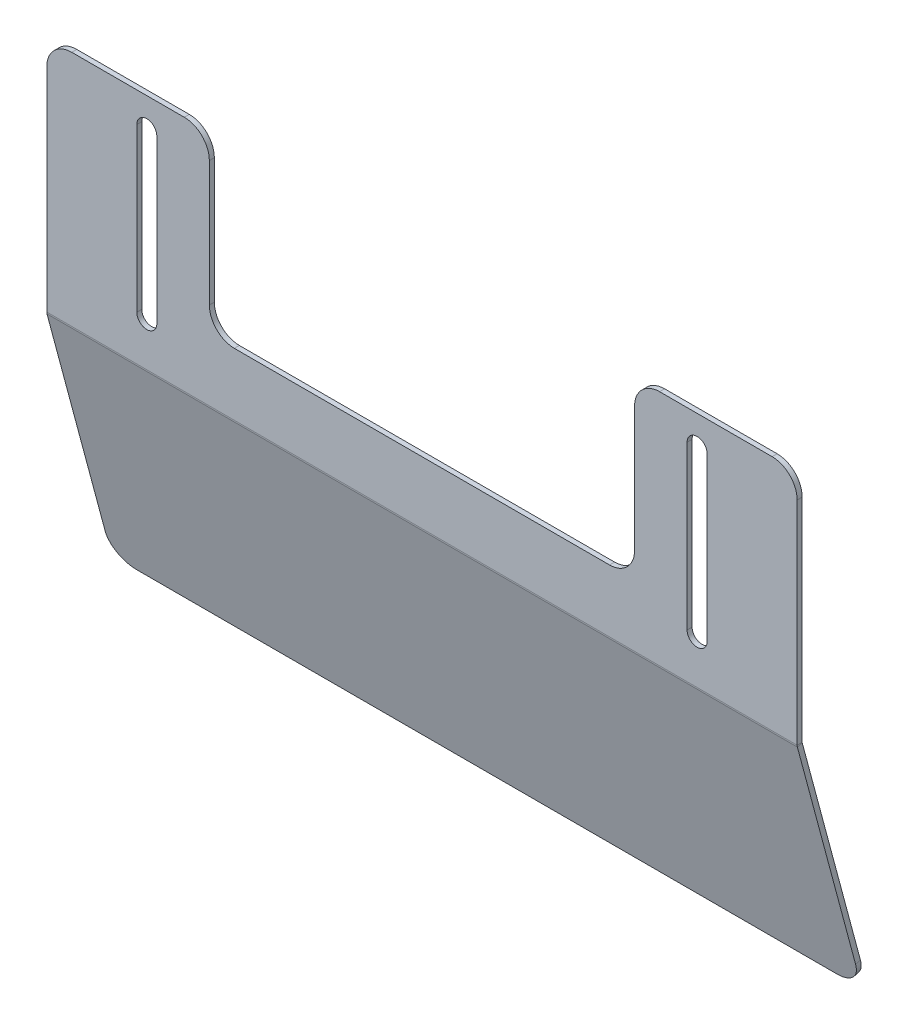
ISO-10303-21;
HEADER;
FILE_DESCRIPTION(('STEP AP214'),'2;1');
FILE_NAME('part.step','',(''),(''),'','','');
FILE_SCHEMA(('AUTOMOTIVE_DESIGN { 1 0 10303 214 1 1 1 1 }'));
ENDSEC;
DATA;
#1=APPLICATION_CONTEXT('core data for automotive mechanical design processes');
#2=APPLICATION_PROTOCOL_DEFINITION('international standard','automotive_design',2000,#1);
#3=PRODUCT_CONTEXT('',#1,'mechanical');
#4=PRODUCT('Part','Part','',(#3));
#5=PRODUCT_RELATED_PRODUCT_CATEGORY('part','',(#4));
#6=PRODUCT_DEFINITION_FORMATION('','',#4);
#7=PRODUCT_DEFINITION_CONTEXT('part definition',#1,'design');
#8=PRODUCT_DEFINITION('design','',#6,#7);
#9=PRODUCT_DEFINITION_SHAPE('','',#8);
#10=(LENGTH_UNIT() NAMED_UNIT(*) SI_UNIT(.MILLI.,.METRE.));
#11=(NAMED_UNIT(*) PLANE_ANGLE_UNIT() SI_UNIT($,.RADIAN.));
#12=(NAMED_UNIT(*) SI_UNIT($,.STERADIAN.) SOLID_ANGLE_UNIT());
#13=UNCERTAINTY_MEASURE_WITH_UNIT(LENGTH_MEASURE(1.E-05),#10,'distance_accuracy_value','');
#14=(GEOMETRIC_REPRESENTATION_CONTEXT(3) GLOBAL_UNCERTAINTY_ASSIGNED_CONTEXT((#13)) GLOBAL_UNIT_ASSIGNED_CONTEXT((#10,
#11,#12)) REPRESENTATION_CONTEXT('',''));
#15=CARTESIAN_POINT('',(0.,0.,0.));
#16=DIRECTION('',(0.,0.,1.));
#17=DIRECTION('',(1.,0.,0.));
#18=AXIS2_PLACEMENT_3D('',#15,#16,#17);
#19=CARTESIAN_POINT('',(-106.,35.5,0.));
#20=DIRECTION('',(-1.,0.,0.));
#21=DIRECTION('',(0.,1.,0.));
#22=AXIS2_PLACEMENT_3D('',#19,#20,#21);
#23=PLANE('',#22);
#24=DIRECTION('',(0.,0.,1.));
#25=VECTOR('',#24,1.);
#26=CARTESIAN_POINT('',(-106.,35.5,0.));
#27=LINE('',#26,#25);
#28=CARTESIAN_POINT('',(-106.,35.5,-2.));
#29=VERTEX_POINT('',#28);
#30=CARTESIAN_POINT('',(-106.,35.5,0.));
#31=VERTEX_POINT('',#30);
#32=EDGE_CURVE('E11',#29,#31,#27,.T.);
#33=ORIENTED_EDGE('',*,*,#32,.F.);
#34=DIRECTION('',(0.,1.,0.));
#35=VECTOR('',#34,1.);
#36=CARTESIAN_POINT('',(-106.,0.,-2.));
#37=LINE('',#36,#35);
#38=CARTESIAN_POINT('',(-106.,-29.5,-2.));
#39=VERTEX_POINT('',#38);
#40=EDGE_CURVE('E170',#39,#29,#37,.T.);
#41=ORIENTED_EDGE('',*,*,#40,.F.);
#42=DIRECTION('',(0.,0.,1.));
#43=VECTOR('',#42,1.);
#44=CARTESIAN_POINT('',(-106.,-29.5,0.));
#45=LINE('',#44,#43);
#46=CARTESIAN_POINT('',(-106.,-29.5,0.));
#47=VERTEX_POINT('',#46);
#48=EDGE_CURVE('E49',#39,#47,#45,.T.);
#49=ORIENTED_EDGE('',*,*,#48,.T.);
#50=DIRECTION('',(0.,1.,0.));
#51=VECTOR('',#50,1.);
#52=CARTESIAN_POINT('',(-106.,35.5,0.));
#53=LINE('',#52,#51);
#54=EDGE_CURVE('E261',#47,#31,#53,.T.);
#55=ORIENTED_EDGE('',*,*,#54,.T.);
#56=EDGE_LOOP('',(#33,#41,#49,#55));
#57=FACE_BOUND('',#56,.T.);
#58=ADVANCED_FACE('F39',(#57),#23,.T.);
#59=CARTESIAN_POINT('',(-110.,-29.5,0.));
#60=DIRECTION('',(0.,0.,-1.));
#61=DIRECTION('',(-1.,0.,0.));
#62=AXIS2_PLACEMENT_3D('',#59,#60,#61);
#63=CYLINDRICAL_SURFACE('',#62,4.);
#64=ORIENTED_EDGE('',*,*,#48,.F.);
#65=CARTESIAN_POINT('',(-110.,-29.5,-2.));
#66=DIRECTION('',(0.,0.,1.));
#67=DIRECTION('',(1.,0.,0.));
#68=AXIS2_PLACEMENT_3D('',#65,#66,#67);
#69=CIRCLE('',#68,4.);
#70=CARTESIAN_POINT('',(-114.,-29.5,-2.));
#71=VERTEX_POINT('',#70);
#72=EDGE_CURVE('E183',#71,#39,#69,.T.);
#73=ORIENTED_EDGE('',*,*,#72,.F.);
#74=DIRECTION('',(0.,0.,1.));
#75=VECTOR('',#74,1.);
#76=CARTESIAN_POINT('',(-114.,-29.5,0.));
#77=LINE('',#76,#75);
#78=CARTESIAN_POINT('',(-114.,-29.5,0.));
#79=VERTEX_POINT('',#78);
#80=EDGE_CURVE('E161',#71,#79,#77,.T.);
#81=ORIENTED_EDGE('',*,*,#80,.T.);
#82=CARTESIAN_POINT('',(-110.,-29.5,0.));
#83=DIRECTION('',(0.,0.,1.));
#84=DIRECTION('',(1.,0.,0.));
#85=AXIS2_PLACEMENT_3D('',#82,#83,#84);
#86=CIRCLE('',#85,4.);
#87=EDGE_CURVE('E270',#79,#47,#86,.T.);
#88=ORIENTED_EDGE('',*,*,#87,.T.);
#89=EDGE_LOOP('',(#64,#73,#81,#88));
#90=FACE_BOUND('',#89,.T.);
#91=ADVANCED_FACE('F272',(#90),#63,.F.);
#92=CARTESIAN_POINT('',(-114.,35.5,0.));
#93=DIRECTION('',(1.,0.,0.));
#94=DIRECTION('',(0.,-1.,0.));
#95=AXIS2_PLACEMENT_3D('',#92,#93,#94);
#96=PLANE('',#95);
#97=ORIENTED_EDGE('',*,*,#80,.F.);
#98=DIRECTION('',(0.,1.,0.));
#99=VECTOR('',#98,1.);
#100=CARTESIAN_POINT('',(-114.,0.,-2.));
#101=LINE('',#100,#99);
#102=CARTESIAN_POINT('',(-114.,35.5,-2.));
#103=VERTEX_POINT('',#102);
#104=EDGE_CURVE('E168',#103,#71,#101,.F.);
#105=ORIENTED_EDGE('',*,*,#104,.F.);
#106=DIRECTION('',(0.,0.,1.));
#107=VECTOR('',#106,1.);
#108=CARTESIAN_POINT('',(-114.,35.5,0.));
#109=LINE('',#108,#107);
#110=CARTESIAN_POINT('',(-114.,35.5,0.));
#111=VERTEX_POINT('',#110);
#112=EDGE_CURVE('E43',#103,#111,#109,.T.);
#113=ORIENTED_EDGE('',*,*,#112,.T.);
#114=DIRECTION('',(0.,-1.,0.));
#115=VECTOR('',#114,1.);
#116=CARTESIAN_POINT('',(-114.,35.5,0.));
#117=LINE('',#116,#115);
#118=EDGE_CURVE('E969',#111,#79,#117,.T.);
#119=ORIENTED_EDGE('',*,*,#118,.T.);
#120=EDGE_LOOP('',(#97,#105,#113,#119));
#121=FACE_BOUND('',#120,.T.);
#122=ADVANCED_FACE('F172',(#121),#96,.T.);
#123=CARTESIAN_POINT('',(106.,35.5,0.));
#124=DIRECTION('',(1.,0.,0.));
#125=DIRECTION('',(0.,-1.,0.));
#126=AXIS2_PLACEMENT_3D('',#123,#124,#125);
#127=PLANE('',#126);
#128=DIRECTION('',(0.,0.,1.));
#129=VECTOR('',#128,1.);
#130=CARTESIAN_POINT('',(106.,-29.5,0.));
#131=LINE('',#130,#129);
#132=CARTESIAN_POINT('',(106.,-29.5,-2.));
#133=VERTEX_POINT('',#132);
#134=CARTESIAN_POINT('',(106.,-29.5,0.));
#135=VERTEX_POINT('',#134);
#136=EDGE_CURVE('E162',#133,#135,#131,.T.);
#137=ORIENTED_EDGE('',*,*,#136,.F.);
#138=DIRECTION('',(0.,1.,0.));
#139=VECTOR('',#138,1.);
#140=CARTESIAN_POINT('',(106.,0.,-2.));
#141=LINE('',#140,#139);
#142=CARTESIAN_POINT('',(106.,35.5,-2.));
#143=VERTEX_POINT('',#142);
#144=EDGE_CURVE('E177',#143,#133,#141,.F.);
#145=ORIENTED_EDGE('',*,*,#144,.F.);
#146=DIRECTION('',(0.,0.,1.));
#147=VECTOR('',#146,1.);
#148=CARTESIAN_POINT('',(106.,35.5,0.));
#149=LINE('',#148,#147);
#150=CARTESIAN_POINT('',(106.,35.5,0.));
#151=VERTEX_POINT('',#150);
#152=EDGE_CURVE('E249',#143,#151,#149,.T.);
#153=ORIENTED_EDGE('',*,*,#152,.T.);
#154=DIRECTION('',(0.,-1.,0.));
#155=VECTOR('',#154,1.);
#156=CARTESIAN_POINT('',(106.,35.5,0.));
#157=LINE('',#156,#155);
#158=EDGE_CURVE('E964',#151,#135,#157,.T.);
#159=ORIENTED_EDGE('',*,*,#158,.T.);
#160=EDGE_LOOP('',(#137,#145,#153,#159));
#161=FACE_BOUND('',#160,.T.);
#162=ADVANCED_FACE('F531',(#161),#127,.T.);
#163=CARTESIAN_POINT('',(110.,35.5,0.));
#164=DIRECTION('',(0.,0.,-1.));
#165=DIRECTION('',(-1.,0.,0.));
#166=AXIS2_PLACEMENT_3D('',#163,#164,#165);
#167=CYLINDRICAL_SURFACE('',#166,4.00000000000002);
#168=ORIENTED_EDGE('',*,*,#152,.F.);
#169=CARTESIAN_POINT('',(110.,35.5,-2.));
#170=DIRECTION('',(0.,0.,1.));
#171=DIRECTION('',(1.,0.,0.));
#172=AXIS2_PLACEMENT_3D('',#169,#170,#171);
#173=CIRCLE('',#172,4.00000000000002);
#174=CARTESIAN_POINT('',(114.,35.5,-2.));
#175=VERTEX_POINT('',#174);
#176=EDGE_CURVE('E174',#175,#143,#173,.T.);
#177=ORIENTED_EDGE('',*,*,#176,.F.);
#178=DIRECTION('',(0.,0.,1.));
#179=VECTOR('',#178,1.);
#180=CARTESIAN_POINT('',(114.,35.5,0.));
#181=LINE('',#180,#179);
#182=CARTESIAN_POINT('',(114.,35.5,0.));
#183=VERTEX_POINT('',#182);
#184=EDGE_CURVE('E246',#175,#183,#181,.T.);
#185=ORIENTED_EDGE('',*,*,#184,.T.);
#186=CARTESIAN_POINT('',(110.,35.5,0.));
#187=DIRECTION('',(0.,0.,1.));
#188=DIRECTION('',(-1.,0.,0.));
#189=AXIS2_PLACEMENT_3D('',#186,#187,#188);
#190=CIRCLE('',#189,4.00000000000002);
#191=EDGE_CURVE('E424',#183,#151,#190,.T.);
#192=ORIENTED_EDGE('',*,*,#191,.T.);
#193=EDGE_LOOP('',(#168,#177,#185,#192));
#194=FACE_BOUND('',#193,.T.);
#195=ADVANCED_FACE('F422',(#194),#167,.F.);
#196=CARTESIAN_POINT('',(114.,35.5,0.));
#197=DIRECTION('',(-1.,0.,0.));
#198=DIRECTION('',(0.,1.,0.));
#199=AXIS2_PLACEMENT_3D('',#196,#197,#198);
#200=PLANE('',#199);
#201=ORIENTED_EDGE('',*,*,#184,.F.);
#202=DIRECTION('',(0.,1.,0.));
#203=VECTOR('',#202,1.);
#204=CARTESIAN_POINT('',(114.,0.,-2.));
#205=LINE('',#204,#203);
#206=CARTESIAN_POINT('',(114.,-29.5,-2.));
#207=VERTEX_POINT('',#206);
#208=EDGE_CURVE('E404',#207,#175,#205,.T.);
#209=ORIENTED_EDGE('',*,*,#208,.F.);
#210=DIRECTION('',(0.,0.,1.));
#211=VECTOR('',#210,1.);
#212=CARTESIAN_POINT('',(114.,-29.5,0.));
#213=LINE('',#212,#211);
#214=CARTESIAN_POINT('',(114.,-29.5,0.));
#215=VERTEX_POINT('',#214);
#216=EDGE_CURVE('E243',#207,#215,#213,.T.);
#217=ORIENTED_EDGE('',*,*,#216,.T.);
#218=DIRECTION('',(0.,1.,0.));
#219=VECTOR('',#218,1.);
#220=CARTESIAN_POINT('',(114.,35.5,0.));
#221=LINE('',#220,#219);
#222=EDGE_CURVE('E390',#215,#183,#221,.T.);
#223=ORIENTED_EDGE('',*,*,#222,.T.);
#224=EDGE_LOOP('',(#201,#209,#217,#223));
#225=FACE_BOUND('',#224,.T.);
#226=ADVANCED_FACE('F415',(#225),#200,.T.);
#227=CARTESIAN_POINT('',(-140.,-134.950962456221,-23.3618624066482));
#228=DIRECTION('',(0.,0.258819045102515,-0.96592582628907));
#229=DIRECTION('',(0.,0.96592582628907,0.258819045102515));
#230=AXIS2_PLACEMENT_3D('',#227,#228,#229);
#231=CYLINDRICAL_SURFACE('',#230,10.);
#232=DIRECTION('',(0.,-0.258819045102515,0.96592582628907));
#233=VECTOR('',#232,1.);
#234=CARTESIAN_POINT('',(-150.,-134.950962456221,-23.3618624066482));
#235=LINE('',#234,#233);
#236=CARTESIAN_POINT('',(-150.,-134.433324366016,-25.2937140592263));
#237=VERTEX_POINT('',#236);
#238=CARTESIAN_POINT('',(-150.,-134.950962456221,-23.3618624066482));
#239=VERTEX_POINT('',#238);
#240=EDGE_CURVE('E240',#237,#239,#235,.T.);
#241=ORIENTED_EDGE('',*,*,#240,.F.);
#242=CARTESIAN_POINT('',(-140.,-134.433324366016,-25.2937140592263));
#243=DIRECTION('',(0.,0.258819045102515,-0.96592582628907));
#244=DIRECTION('',(0.,0.96592582628907,0.258819045102515));
#245=AXIS2_PLACEMENT_3D('',#242,#243,#244);
#246=CIRCLE('',#245,10.);
#247=CARTESIAN_POINT('',(-140.,-144.092582628907,-27.8819045102515));
#248=VERTEX_POINT('',#247);
#249=EDGE_CURVE('E399',#237,#248,#246,.F.);
#250=ORIENTED_EDGE('',*,*,#249,.T.);
#251=DIRECTION('',(0.,-0.258819045102515,0.96592582628907));
#252=VECTOR('',#251,1.);
#253=CARTESIAN_POINT('',(-140.,-144.610220719112,-25.9500528576733));
#254=LINE('',#253,#252);
#255=CARTESIAN_POINT('',(-140.,-144.610220719112,-25.9500528576733));
#256=VERTEX_POINT('',#255);
#257=EDGE_CURVE('E237',#248,#256,#254,.T.);
#258=ORIENTED_EDGE('',*,*,#257,.T.);
#259=CARTESIAN_POINT('',(-140.,-134.950962456221,-23.3618624066482));
#260=DIRECTION('',(0.,0.258819045102515,-0.96592582628907));
#261=DIRECTION('',(0.,0.96592582628907,0.258819045102515));
#262=AXIS2_PLACEMENT_3D('',#259,#260,#261);
#263=CIRCLE('',#262,10.);
#264=EDGE_CURVE('E319',#239,#256,#263,.F.);
#265=ORIENTED_EDGE('',*,*,#264,.F.);
#266=EDGE_LOOP('',(#241,#250,#258,#265));
#267=FACE_BOUND('',#266,.T.);
#268=ADVANCED_FACE('F511',(#267),#231,.T.);
#269=CARTESIAN_POINT('',(150.,-144.610220719112,-25.9500528576733));
#270=DIRECTION('',(0.,0.96592582628907,0.258819045102515));
#271=DIRECTION('',(1.,0.,0.));
#272=AXIS2_PLACEMENT_3D('',#269,#270,#271);
#273=PLANE('',#272);
#274=ORIENTED_EDGE('',*,*,#257,.F.);
#275=DIRECTION('',(1.,0.,0.));
#276=VECTOR('',#275,1.);
#277=CARTESIAN_POINT('',(0.,-144.092582628907,-27.8819045102515));
#278=LINE('',#277,#276);
#279=CARTESIAN_POINT('',(140.,-144.092582628907,-27.8819045102515));
#280=VERTEX_POINT('',#279);
#281=EDGE_CURVE('E396',#248,#280,#278,.T.);
#282=ORIENTED_EDGE('',*,*,#281,.T.);
#283=DIRECTION('',(0.,-0.258819045102515,0.96592582628907));
#284=VECTOR('',#283,1.);
#285=CARTESIAN_POINT('',(140.,-144.610220719112,-25.9500528576733));
#286=LINE('',#285,#284);
#287=CARTESIAN_POINT('',(140.,-144.610220719112,-25.9500528576733));
#288=VERTEX_POINT('',#287);
#289=EDGE_CURVE('E234',#280,#288,#286,.T.);
#290=ORIENTED_EDGE('',*,*,#289,.T.);
#291=DIRECTION('',(1.,0.,0.));
#292=VECTOR('',#291,1.);
#293=CARTESIAN_POINT('',(150.,-144.610220719112,-25.9500528576733));
#294=LINE('',#293,#292);
#295=EDGE_CURVE('E322',#256,#288,#294,.T.);
#296=ORIENTED_EDGE('',*,*,#295,.F.);
#297=EDGE_LOOP('',(#274,#282,#290,#296));
#298=FACE_BOUND('',#297,.T.);
#299=ADVANCED_FACE('F514',(#298),#273,.F.);
#300=CARTESIAN_POINT('',(140.,-134.950962456221,-23.3618624066482));
#301=DIRECTION('',(0.,0.258819045102515,-0.96592582628907));
#302=DIRECTION('',(0.,0.96592582628907,0.258819045102515));
#303=AXIS2_PLACEMENT_3D('',#300,#301,#302);
#304=CYLINDRICAL_SURFACE('',#303,10.);
#305=ORIENTED_EDGE('',*,*,#289,.F.);
#306=CARTESIAN_POINT('',(140.,-134.433324366016,-25.2937140592263));
#307=DIRECTION('',(0.,0.258819045102515,-0.96592582628907));
#308=DIRECTION('',(0.,0.96592582628907,0.258819045102515));
#309=AXIS2_PLACEMENT_3D('',#306,#307,#308);
#310=CIRCLE('',#309,10.);
#311=CARTESIAN_POINT('',(150.,-134.433324366016,-25.2937140592263));
#312=VERTEX_POINT('',#311);
#313=EDGE_CURVE('E393',#280,#312,#310,.F.);
#314=ORIENTED_EDGE('',*,*,#313,.T.);
#315=DIRECTION('',(0.,-0.258819045102515,0.96592582628907));
#316=VECTOR('',#315,1.);
#317=CARTESIAN_POINT('',(150.,-134.950962456221,-23.3618624066482));
#318=LINE('',#317,#316);
#319=CARTESIAN_POINT('',(150.,-134.950962456221,-23.3618624066482));
#320=VERTEX_POINT('',#319);
#321=EDGE_CURVE('E231',#312,#320,#318,.T.);
#322=ORIENTED_EDGE('',*,*,#321,.T.);
#323=CARTESIAN_POINT('',(140.,-134.950962456221,-23.3618624066482));
#324=DIRECTION('',(0.,0.258819045102515,-0.96592582628907));
#325=DIRECTION('',(0.,0.96592582628907,0.258819045102515));
#326=AXIS2_PLACEMENT_3D('',#323,#324,#325);
#327=CIRCLE('',#326,10.);
#328=EDGE_CURVE('E325',#288,#320,#327,.F.);
#329=ORIENTED_EDGE('',*,*,#328,.F.);
#330=EDGE_LOOP('',(#305,#314,#322,#329));
#331=FACE_BOUND('',#330,.T.);
#332=ADVANCED_FACE('F468',(#331),#304,.T.);
#333=CARTESIAN_POINT('',(150.,-48.017638090205,-0.0681483474218618));
#334=DIRECTION('',(-1.,0.,0.));
#335=DIRECTION('',(0.,0.96592582628907,0.258819045102515));
#336=AXIS2_PLACEMENT_3D('',#333,#334,#335);
#337=PLANE('',#336);
#338=ORIENTED_EDGE('',*,*,#321,.F.);
#339=DIRECTION('',(0.,0.96592582628907,0.258819045102515));
#340=VECTOR('',#339,1.);
#341=CARTESIAN_POINT('',(150.,-2.68189666011944,10.0089745962153));
#342=LINE('',#341,#340);
#343=CARTESIAN_POINT('',(150.,-47.5936708788996,-2.02509903635547));
#344=VERTEX_POINT('',#343);
#345=EDGE_CURVE('E347',#312,#344,#342,.T.);
#346=ORIENTED_EDGE('',*,*,#345,.T.);
#347=DIRECTION('',(0.,-0.258819045102515,0.96592582628907));
#348=VECTOR('',#347,1.);
#349=CARTESIAN_POINT('',(150.,-48.1113089691047,-0.0932473837773305));
#350=LINE('',#349,#348);
#351=CARTESIAN_POINT('',(150.,-48.1113089691047,-0.0932473837773305));
#352=VERTEX_POINT('',#351);
#353=EDGE_CURVE('E229',#344,#352,#350,.T.);
#354=ORIENTED_EDGE('',*,*,#353,.T.);
#355=DIRECTION('',(0.,0.96592582628907,0.258819045102515));
#356=VECTOR('',#355,1.);
#357=CARTESIAN_POINT('',(150.,-48.017638090205,-0.0681483474218618));
#358=LINE('',#357,#356);
#359=EDGE_CURVE('E328',#320,#352,#358,.T.);
#360=ORIENTED_EDGE('',*,*,#359,.F.);
#361=EDGE_LOOP('',(#338,#346,#354,#360));
#362=FACE_BOUND('',#361,.T.);
#363=ADVANCED_FACE('F477',(#362),#337,.F.);
#364=CARTESIAN_POINT('',(150.,-47.4030247702771,-2.73659999999996));
#365=DIRECTION('',(1.,0.,0.));
#366=DIRECTION('',(0.,0.,-1.));
#367=AXIS2_PLACEMENT_3D('',#364,#365,#366);
#368=PLANE('',#367);
#369=ORIENTED_EDGE('',*,*,#353,.F.);
#370=CARTESIAN_POINT('',(150.,-47.4030247702771,-2.73659999999996));
#371=DIRECTION('',(-1.,0.,0.));
#372=DIRECTION('',(0.,0.,1.));
#373=AXIS2_PLACEMENT_3D('',#370,#371,#372);
#374=CIRCLE('',#373,0.736599999999963);
#375=CARTESIAN_POINT('',(150.,-47.4030247702771,-2.));
#376=VERTEX_POINT('',#375);
#377=EDGE_CURVE('E350',#376,#344,#374,.F.);
#378=ORIENTED_EDGE('',*,*,#377,.F.);
#379=DIRECTION('',(0.,0.,1.));
#380=VECTOR('',#379,1.);
#381=CARTESIAN_POINT('',(150.,-47.4030247702771,0.));
#382=LINE('',#381,#380);
#383=CARTESIAN_POINT('',(150.,-47.4030247702771,0.));
#384=VERTEX_POINT('',#383);
#385=EDGE_CURVE('E226',#376,#384,#382,.T.);
#386=ORIENTED_EDGE('',*,*,#385,.T.);
#387=CARTESIAN_POINT('',(150.,-47.4030247702771,-2.73659999999996));
#388=DIRECTION('',(-1.,0.,0.));
#389=DIRECTION('',(0.,0.,1.));
#390=AXIS2_PLACEMENT_3D('',#387,#388,#389);
#391=CIRCLE('',#390,2.73659999999996);
#392=EDGE_CURVE('E245',#384,#352,#391,.F.);
#393=ORIENTED_EDGE('',*,*,#392,.T.);
#394=EDGE_LOOP('',(#369,#378,#386,#393));
#395=FACE_BOUND('',#394,.T.);
#396=ADVANCED_FACE('F480',(#395),#368,.T.);
#397=CARTESIAN_POINT('',(150.,-47.5,0.));
#398=DIRECTION('',(-1.,0.,0.));
#399=DIRECTION('',(0.,1.,0.));
#400=AXIS2_PLACEMENT_3D('',#397,#398,#399);
#401=PLANE('',#400);
#402=ORIENTED_EDGE('',*,*,#385,.F.);
#403=DIRECTION('',(0.,1.,0.));
#404=VECTOR('',#403,1.);
#405=CARTESIAN_POINT('',(150.,0.,-2.));
#406=LINE('',#405,#404);
#407=CARTESIAN_POINT('',(150.,37.5,-2.));
#408=VERTEX_POINT('',#407);
#409=EDGE_CURVE('E341',#376,#408,#406,.T.);
#410=ORIENTED_EDGE('',*,*,#409,.T.);
#411=DIRECTION('',(0.,0.,1.));
#412=VECTOR('',#411,1.);
#413=CARTESIAN_POINT('',(150.,37.5,0.));
#414=LINE('',#413,#412);
#415=CARTESIAN_POINT('',(150.,37.5,0.));
#416=VERTEX_POINT('',#415);
#417=EDGE_CURVE('E223',#408,#416,#414,.T.);
#418=ORIENTED_EDGE('',*,*,#417,.T.);
#419=DIRECTION('',(0.,1.,0.));
#420=VECTOR('',#419,1.);
#421=CARTESIAN_POINT('',(150.,-47.5,0.));
#422=LINE('',#421,#420);
#423=EDGE_CURVE('E310',#384,#416,#422,.T.);
#424=ORIENTED_EDGE('',*,*,#423,.F.);
#425=EDGE_LOOP('',(#402,#410,#418,#424));
#426=FACE_BOUND('',#425,.T.);
#427=ADVANCED_FACE('F495',(#426),#401,.F.);
#428=CARTESIAN_POINT('',(140.,37.5,0.));
#429=DIRECTION('',(0.,0.,-1.));
#430=DIRECTION('',(-1.,0.,0.));
#431=AXIS2_PLACEMENT_3D('',#428,#429,#430);
#432=CYLINDRICAL_SURFACE('',#431,10.);
#433=ORIENTED_EDGE('',*,*,#417,.F.);
#434=CARTESIAN_POINT('',(140.,37.5,-2.));
#435=DIRECTION('',(0.,0.,-1.));
#436=DIRECTION('',(-1.,0.,0.));
#437=AXIS2_PLACEMENT_3D('',#434,#435,#436);
#438=CIRCLE('',#437,10.);
#439=CARTESIAN_POINT('',(140.,47.5,-2.));
#440=VERTEX_POINT('',#439);
#441=EDGE_CURVE('E382',#408,#440,#438,.F.);
#442=ORIENTED_EDGE('',*,*,#441,.T.);
#443=DIRECTION('',(0.,0.,1.));
#444=VECTOR('',#443,1.);
#445=CARTESIAN_POINT('',(140.,47.5,0.));
#446=LINE('',#445,#444);
#447=CARTESIAN_POINT('',(140.,47.5,0.));
#448=VERTEX_POINT('',#447);
#449=EDGE_CURVE('E220',#440,#448,#446,.T.);
#450=ORIENTED_EDGE('',*,*,#449,.T.);
#451=CARTESIAN_POINT('',(140.,37.5,0.));
#452=DIRECTION('',(0.,0.,-1.));
#453=DIRECTION('',(-1.,0.,0.));
#454=AXIS2_PLACEMENT_3D('',#451,#452,#453);
#455=CIRCLE('',#454,10.);
#456=EDGE_CURVE('E313',#416,#448,#455,.F.);
#457=ORIENTED_EDGE('',*,*,#456,.F.);
#458=EDGE_LOOP('',(#433,#442,#450,#457));
#459=FACE_BOUND('',#458,.T.);
#460=ADVANCED_FACE('F646',(#459),#432,.T.);
#461=CARTESIAN_POINT('',(-150.,47.5,0.));
#462=DIRECTION('',(0.,-1.,0.));
#463=DIRECTION('',(-1.,0.,0.));
#464=AXIS2_PLACEMENT_3D('',#461,#462,#463);
#465=PLANE('',#464);
#466=ORIENTED_EDGE('',*,*,#449,.F.);
#467=DIRECTION('',(-1.,0.,0.));
#468=VECTOR('',#467,1.);
#469=CARTESIAN_POINT('',(0.,47.5,-2.));
#470=LINE('',#469,#468);
#471=CARTESIAN_POINT('',(95.,47.5,-2.));
#472=VERTEX_POINT('',#471);
#473=EDGE_CURVE('E185',#440,#472,#470,.T.);
#474=ORIENTED_EDGE('',*,*,#473,.T.);
#475=DIRECTION('',(0.,0.,1.));
#476=VECTOR('',#475,1.);
#477=CARTESIAN_POINT('',(95.,47.5,0.));
#478=LINE('',#477,#476);
#479=CARTESIAN_POINT('',(95.,47.5,0.));
#480=VERTEX_POINT('',#479);
#481=EDGE_CURVE('E217',#472,#480,#478,.T.);
#482=ORIENTED_EDGE('',*,*,#481,.T.);
#483=DIRECTION('',(-1.,0.,0.));
#484=VECTOR('',#483,1.);
#485=CARTESIAN_POINT('',(-150.,47.5,0.));
#486=LINE('',#485,#484);
#487=EDGE_CURVE('E273',#448,#480,#486,.T.);
#488=ORIENTED_EDGE('',*,*,#487,.F.);
#489=EDGE_LOOP('',(#466,#474,#482,#488));
#490=FACE_BOUND('',#489,.T.);
#491=ADVANCED_FACE('F585',(#490),#465,.F.);
#492=CARTESIAN_POINT('',(95.,37.5,0.));
#493=DIRECTION('',(0.,0.,-1.));
#494=DIRECTION('',(-1.,0.,0.));
#495=AXIS2_PLACEMENT_3D('',#492,#493,#494);
#496=CYLINDRICAL_SURFACE('',#495,10.);
#497=ORIENTED_EDGE('',*,*,#481,.F.);
#498=CARTESIAN_POINT('',(95.,37.5,-2.));
#499=DIRECTION('',(0.,0.,-1.));
#500=DIRECTION('',(-1.,0.,0.));
#501=AXIS2_PLACEMENT_3D('',#498,#499,#500);
#502=CIRCLE('',#501,10.);
#503=CARTESIAN_POINT('',(85.,37.5,-2.));
#504=VERTEX_POINT('',#503);
#505=EDGE_CURVE('E377',#472,#504,#502,.F.);
#506=ORIENTED_EDGE('',*,*,#505,.T.);
#507=DIRECTION('',(0.,0.,1.));
#508=VECTOR('',#507,1.);
#509=CARTESIAN_POINT('',(85.,37.5,0.));
#510=LINE('',#509,#508);
#511=CARTESIAN_POINT('',(85.,37.5,0.));
#512=VERTEX_POINT('',#511);
#513=EDGE_CURVE('E214',#504,#512,#510,.T.);
#514=ORIENTED_EDGE('',*,*,#513,.T.);
#515=CARTESIAN_POINT('',(95.,37.5,0.));
#516=DIRECTION('',(0.,0.,-1.));
#517=DIRECTION('',(-1.,0.,0.));
#518=AXIS2_PLACEMENT_3D('',#515,#516,#517);
#519=CIRCLE('',#518,10.);
#520=EDGE_CURVE('E276',#480,#512,#519,.F.);
#521=ORIENTED_EDGE('',*,*,#520,.F.);
#522=EDGE_LOOP('',(#497,#506,#514,#521));
#523=FACE_BOUND('',#522,.T.);
#524=ADVANCED_FACE('F631',(#523),#496,.T.);
#525=CARTESIAN_POINT('',(85.,47.5,0.));
#526=DIRECTION('',(-1.,0.,0.));
#527=DIRECTION('',(0.,1.,0.));
#528=AXIS2_PLACEMENT_3D('',#525,#526,#527);
#529=PLANE('',#528);
#530=ORIENTED_EDGE('',*,*,#513,.F.);
#531=DIRECTION('',(0.,1.,0.));
#532=VECTOR('',#531,1.);
#533=CARTESIAN_POINT('',(85.,0.,-2.));
#534=LINE('',#533,#532);
#535=CARTESIAN_POINT('',(85.,-12.5,-2.));
#536=VERTEX_POINT('',#535);
#537=EDGE_CURVE('E374',#536,#504,#534,.T.);
#538=ORIENTED_EDGE('',*,*,#537,.F.);
#539=DIRECTION('',(0.,0.,1.));
#540=VECTOR('',#539,1.);
#541=CARTESIAN_POINT('',(85.,-12.5,0.));
#542=LINE('',#541,#540);
#543=CARTESIAN_POINT('',(85.,-12.5,0.));
#544=VERTEX_POINT('',#543);
#545=EDGE_CURVE('E211',#536,#544,#542,.T.);
#546=ORIENTED_EDGE('',*,*,#545,.T.);
#547=DIRECTION('',(0.,1.,0.));
#548=VECTOR('',#547,1.);
#549=CARTESIAN_POINT('',(85.,47.5,0.));
#550=LINE('',#549,#548);
#551=EDGE_CURVE('E283',#544,#512,#550,.T.);
#552=ORIENTED_EDGE('',*,*,#551,.T.);
#553=EDGE_LOOP('',(#530,#538,#546,#552));
#554=FACE_BOUND('',#553,.T.);
#555=ADVANCED_FACE('F623',(#554),#529,.T.);
#556=CARTESIAN_POINT('',(75.,-12.5,0.));
#557=DIRECTION('',(0.,0.,-1.));
#558=DIRECTION('',(-1.,0.,0.));
#559=AXIS2_PLACEMENT_3D('',#556,#557,#558);
#560=CYLINDRICAL_SURFACE('',#559,10.);
#561=ORIENTED_EDGE('',*,*,#545,.F.);
#562=CARTESIAN_POINT('',(75.,-12.5,-2.));
#563=DIRECTION('',(0.,0.,-1.));
#564=DIRECTION('',(-1.,0.,0.));
#565=AXIS2_PLACEMENT_3D('',#562,#563,#564);
#566=CIRCLE('',#565,10.);
#567=CARTESIAN_POINT('',(75.,-22.5,-2.));
#568=VERTEX_POINT('',#567);
#569=EDGE_CURVE('E371',#536,#568,#566,.T.);
#570=ORIENTED_EDGE('',*,*,#569,.T.);
#571=DIRECTION('',(0.,0.,1.));
#572=VECTOR('',#571,1.);
#573=CARTESIAN_POINT('',(75.,-22.5,0.));
#574=LINE('',#573,#572);
#575=CARTESIAN_POINT('',(75.,-22.5,0.));
#576=VERTEX_POINT('',#575);
#577=EDGE_CURVE('E208',#568,#576,#574,.T.);
#578=ORIENTED_EDGE('',*,*,#577,.T.);
#579=CARTESIAN_POINT('',(75.,-12.5,0.));
#580=DIRECTION('',(0.,0.,-1.));
#581=DIRECTION('',(-1.,0.,0.));
#582=AXIS2_PLACEMENT_3D('',#579,#580,#581);
#583=CIRCLE('',#582,10.);
#584=EDGE_CURVE('E286',#544,#576,#583,.T.);
#585=ORIENTED_EDGE('',*,*,#584,.F.);
#586=EDGE_LOOP('',(#561,#570,#578,#585));
#587=FACE_BOUND('',#586,.T.);
#588=ADVANCED_FACE('F615',(#587),#560,.F.);
#589=CARTESIAN_POINT('',(-85.,-22.5,0.));
#590=DIRECTION('',(0.,1.,0.));
#591=DIRECTION('',(1.,0.,0.));
#592=AXIS2_PLACEMENT_3D('',#589,#590,#591);
#593=PLANE('',#592);
#594=ORIENTED_EDGE('',*,*,#577,.F.);
#595=DIRECTION('',(-1.,0.,0.));
#596=VECTOR('',#595,1.);
#597=CARTESIAN_POINT('',(0.,-22.5,-2.));
#598=LINE('',#597,#596);
#599=CARTESIAN_POINT('',(-75.,-22.5,-2.));
#600=VERTEX_POINT('',#599);
#601=EDGE_CURVE('E368',#600,#568,#598,.F.);
#602=ORIENTED_EDGE('',*,*,#601,.F.);
#603=DIRECTION('',(0.,0.,1.));
#604=VECTOR('',#603,1.);
#605=CARTESIAN_POINT('',(-75.,-22.5,0.));
#606=LINE('',#605,#604);
#607=CARTESIAN_POINT('',(-75.,-22.5,0.));
#608=VERTEX_POINT('',#607);
#609=EDGE_CURVE('E205',#600,#608,#606,.T.);
#610=ORIENTED_EDGE('',*,*,#609,.T.);
#611=DIRECTION('',(1.,0.,0.));
#612=VECTOR('',#611,1.);
#613=CARTESIAN_POINT('',(-85.,-22.5,0.));
#614=LINE('',#613,#612);
#615=EDGE_CURVE('E289',#608,#576,#614,.T.);
#616=ORIENTED_EDGE('',*,*,#615,.T.);
#617=EDGE_LOOP('',(#594,#602,#610,#616));
#618=FACE_BOUND('',#617,.T.);
#619=ADVANCED_FACE('F607',(#618),#593,.T.);
#620=CARTESIAN_POINT('',(-75.,-12.5,0.));
#621=DIRECTION('',(0.,0.,-1.));
#622=DIRECTION('',(-1.,0.,0.));
#623=AXIS2_PLACEMENT_3D('',#620,#621,#622);
#624=CYLINDRICAL_SURFACE('',#623,10.);
#625=ORIENTED_EDGE('',*,*,#609,.F.);
#626=CARTESIAN_POINT('',(-75.,-12.5,-2.));
#627=DIRECTION('',(0.,0.,-1.));
#628=DIRECTION('',(-1.,0.,0.));
#629=AXIS2_PLACEMENT_3D('',#626,#627,#628);
#630=CIRCLE('',#629,10.);
#631=CARTESIAN_POINT('',(-85.,-12.5,-2.));
#632=VERTEX_POINT('',#631);
#633=EDGE_CURVE('E365',#600,#632,#630,.T.);
#634=ORIENTED_EDGE('',*,*,#633,.T.);
#635=DIRECTION('',(0.,0.,1.));
#636=VECTOR('',#635,1.);
#637=CARTESIAN_POINT('',(-85.,-12.5,0.));
#638=LINE('',#637,#636);
#639=CARTESIAN_POINT('',(-85.,-12.5,0.));
#640=VERTEX_POINT('',#639);
#641=EDGE_CURVE('E202',#632,#640,#638,.T.);
#642=ORIENTED_EDGE('',*,*,#641,.T.);
#643=CARTESIAN_POINT('',(-75.,-12.5,0.));
#644=DIRECTION('',(0.,0.,-1.));
#645=DIRECTION('',(-1.,0.,0.));
#646=AXIS2_PLACEMENT_3D('',#643,#644,#645);
#647=CIRCLE('',#646,10.);
#648=EDGE_CURVE('E292',#608,#640,#647,.T.);
#649=ORIENTED_EDGE('',*,*,#648,.F.);
#650=EDGE_LOOP('',(#625,#634,#642,#649));
#651=FACE_BOUND('',#650,.T.);
#652=ADVANCED_FACE('F599',(#651),#624,.F.);
#653=CARTESIAN_POINT('',(-85.,47.5,0.));
#654=DIRECTION('',(1.,0.,0.));
#655=DIRECTION('',(0.,-1.,0.));
#656=AXIS2_PLACEMENT_3D('',#653,#654,#655);
#657=PLANE('',#656);
#658=ORIENTED_EDGE('',*,*,#641,.F.);
#659=DIRECTION('',(0.,1.,0.));
#660=VECTOR('',#659,1.);
#661=CARTESIAN_POINT('',(-85.,0.,-2.));
#662=LINE('',#661,#660);
#663=CARTESIAN_POINT('',(-85.,37.5,-2.));
#664=VERTEX_POINT('',#663);
#665=EDGE_CURVE('E362',#664,#632,#662,.F.);
#666=ORIENTED_EDGE('',*,*,#665,.F.);
#667=DIRECTION('',(0.,0.,1.));
#668=VECTOR('',#667,1.);
#669=CARTESIAN_POINT('',(-85.,37.5,0.));
#670=LINE('',#669,#668);
#671=CARTESIAN_POINT('',(-85.,37.5,0.));
#672=VERTEX_POINT('',#671);
#673=EDGE_CURVE('E199',#664,#672,#670,.T.);
#674=ORIENTED_EDGE('',*,*,#673,.T.);
#675=DIRECTION('',(0.,-1.,0.));
#676=VECTOR('',#675,1.);
#677=CARTESIAN_POINT('',(-85.,47.5,0.));
#678=LINE('',#677,#676);
#679=EDGE_CURVE('E295',#672,#640,#678,.T.);
#680=ORIENTED_EDGE('',*,*,#679,.T.);
#681=EDGE_LOOP('',(#658,#666,#674,#680));
#682=FACE_BOUND('',#681,.T.);
#683=ADVANCED_FACE('F591',(#682),#657,.T.);
#684=CARTESIAN_POINT('',(-95.,37.5,0.));
#685=DIRECTION('',(0.,0.,-1.));
#686=DIRECTION('',(-1.,0.,0.));
#687=AXIS2_PLACEMENT_3D('',#684,#685,#686);
#688=CYLINDRICAL_SURFACE('',#687,10.);
#689=ORIENTED_EDGE('',*,*,#673,.F.);
#690=CARTESIAN_POINT('',(-95.,37.5,-2.));
#691=DIRECTION('',(0.,0.,-1.));
#692=DIRECTION('',(-1.,0.,0.));
#693=AXIS2_PLACEMENT_3D('',#690,#691,#692);
#694=CIRCLE('',#693,10.);
#695=CARTESIAN_POINT('',(-95.,47.5,-2.));
#696=VERTEX_POINT('',#695);
#697=EDGE_CURVE('E359',#664,#696,#694,.F.);
#698=ORIENTED_EDGE('',*,*,#697,.T.);
#699=DIRECTION('',(0.,0.,1.));
#700=VECTOR('',#699,1.);
#701=CARTESIAN_POINT('',(-95.,47.5,0.));
#702=LINE('',#701,#700);
#703=CARTESIAN_POINT('',(-95.,47.5,0.));
#704=VERTEX_POINT('',#703);
#705=EDGE_CURVE('E196',#696,#704,#702,.T.);
#706=ORIENTED_EDGE('',*,*,#705,.T.);
#707=CARTESIAN_POINT('',(-95.,37.5,0.));
#708=DIRECTION('',(0.,0.,-1.));
#709=DIRECTION('',(-1.,0.,0.));
#710=AXIS2_PLACEMENT_3D('',#707,#708,#709);
#711=CIRCLE('',#710,10.);
#712=EDGE_CURVE('E298',#672,#704,#711,.F.);
#713=ORIENTED_EDGE('',*,*,#712,.F.);
#714=EDGE_LOOP('',(#689,#698,#706,#713));
#715=FACE_BOUND('',#714,.T.);
#716=ADVANCED_FACE('F582',(#715),#688,.T.);
#717=ORIENTED_EDGE('',*,*,#705,.F.);
#718=DIRECTION('',(-1.,0.,0.));
#719=VECTOR('',#718,1.);
#720=CARTESIAN_POINT('',(0.,47.5,-2.));
#721=LINE('',#720,#719);
#722=CARTESIAN_POINT('',(-140.,47.5,-2.));
#723=VERTEX_POINT('',#722);
#724=EDGE_CURVE('E356',#696,#723,#721,.T.);
#725=ORIENTED_EDGE('',*,*,#724,.T.);
#726=DIRECTION('',(0.,0.,1.));
#727=VECTOR('',#726,1.);
#728=CARTESIAN_POINT('',(-140.,47.5,0.));
#729=LINE('',#728,#727);
#730=CARTESIAN_POINT('',(-140.,47.5,0.));
#731=VERTEX_POINT('',#730);
#732=EDGE_CURVE('E193',#723,#731,#729,.T.);
#733=ORIENTED_EDGE('',*,*,#732,.T.);
#734=EDGE_CURVE('E278',#704,#731,#486,.T.);
#735=ORIENTED_EDGE('',*,*,#734,.F.);
#736=EDGE_LOOP('',(#717,#725,#733,#735));
#737=FACE_BOUND('',#736,.T.);
#738=ADVANCED_FACE('F574',(#737),#465,.F.);
#739=CARTESIAN_POINT('',(-140.,37.5,0.));
#740=DIRECTION('',(0.,0.,-1.));
#741=DIRECTION('',(-1.,0.,0.));
#742=AXIS2_PLACEMENT_3D('',#739,#740,#741);
#743=CYLINDRICAL_SURFACE('',#742,10.);
#744=ORIENTED_EDGE('',*,*,#732,.F.);
#745=CARTESIAN_POINT('',(-140.,37.5,-2.));
#746=DIRECTION('',(0.,0.,-1.));
#747=DIRECTION('',(-1.,0.,0.));
#748=AXIS2_PLACEMENT_3D('',#745,#746,#747);
#749=CIRCLE('',#748,10.);
#750=CARTESIAN_POINT('',(-150.,37.5,-2.));
#751=VERTEX_POINT('',#750);
#752=EDGE_CURVE('E353',#723,#751,#749,.F.);
#753=ORIENTED_EDGE('',*,*,#752,.T.);
#754=DIRECTION('',(0.,0.,1.));
#755=VECTOR('',#754,1.);
#756=CARTESIAN_POINT('',(-150.,37.5,0.));
#757=LINE('',#756,#755);
#758=CARTESIAN_POINT('',(-150.,37.5,0.));
#759=VERTEX_POINT('',#758);
#760=EDGE_CURVE('E190',#751,#759,#757,.T.);
#761=ORIENTED_EDGE('',*,*,#760,.T.);
#762=CARTESIAN_POINT('',(-140.,37.5,0.));
#763=DIRECTION('',(0.,0.,-1.));
#764=DIRECTION('',(-1.,0.,0.));
#765=AXIS2_PLACEMENT_3D('',#762,#763,#764);
#766=CIRCLE('',#765,10.);
#767=EDGE_CURVE('E301',#731,#759,#766,.F.);
#768=ORIENTED_EDGE('',*,*,#767,.F.);
#769=EDGE_LOOP('',(#744,#753,#761,#768));
#770=FACE_BOUND('',#769,.T.);
#771=ADVANCED_FACE('F567',(#770),#743,.T.);
#772=CARTESIAN_POINT('',(-150.,-47.5,0.));
#773=DIRECTION('',(1.,0.,0.));
#774=DIRECTION('',(0.,-1.,0.));
#775=AXIS2_PLACEMENT_3D('',#772,#773,#774);
#776=PLANE('',#775);
#777=ORIENTED_EDGE('',*,*,#760,.F.);
#778=DIRECTION('',(0.,1.,0.));
#779=VECTOR('',#778,1.);
#780=CARTESIAN_POINT('',(-150.,0.,-2.));
#781=LINE('',#780,#779);
#782=CARTESIAN_POINT('',(-150.,-47.4030247702771,-2.));
#783=VERTEX_POINT('',#782);
#784=EDGE_CURVE('E342',#751,#783,#781,.F.);
#785=ORIENTED_EDGE('',*,*,#784,.T.);
#786=DIRECTION('',(0.,0.,1.));
#787=VECTOR('',#786,1.);
#788=CARTESIAN_POINT('',(-150.,-47.4030247702771,0.));
#789=LINE('',#788,#787);
#790=CARTESIAN_POINT('',(-150.,-47.4030247702771,0.));
#791=VERTEX_POINT('',#790);
#792=EDGE_CURVE('E187',#783,#791,#789,.T.);
#793=ORIENTED_EDGE('',*,*,#792,.T.);
#794=DIRECTION('',(0.,-1.,0.));
#795=VECTOR('',#794,1.);
#796=CARTESIAN_POINT('',(-150.,-47.5,0.));
#797=LINE('',#796,#795);
#798=EDGE_CURVE('E304',#759,#791,#797,.T.);
#799=ORIENTED_EDGE('',*,*,#798,.F.);
#800=EDGE_LOOP('',(#777,#785,#793,#799));
#801=FACE_BOUND('',#800,.T.);
#802=ADVANCED_FACE('F560',(#801),#776,.F.);
#803=CARTESIAN_POINT('',(-150.,-47.4030247702771,-2.73659999999996));
#804=DIRECTION('',(1.,0.,0.));
#805=DIRECTION('',(0.,0.,-1.));
#806=AXIS2_PLACEMENT_3D('',#803,#804,#805);
#807=PLANE('',#806);
#808=ORIENTED_EDGE('',*,*,#792,.F.);
#809=CARTESIAN_POINT('',(-150.,-47.4030247702771,-2.73659999999996));
#810=DIRECTION('',(-1.,0.,0.));
#811=DIRECTION('',(0.,0.,1.));
#812=AXIS2_PLACEMENT_3D('',#809,#810,#811);
#813=CIRCLE('',#812,0.736599999999963);
#814=CARTESIAN_POINT('',(-150.,-47.5936708788996,-2.02509903635547));
#815=VERTEX_POINT('',#814);
#816=EDGE_CURVE('E346',#815,#783,#813,.T.);
#817=ORIENTED_EDGE('',*,*,#816,.F.);
#818=DIRECTION('',(0.,-0.258819045102515,0.96592582628907));
#819=VECTOR('',#818,1.);
#820=CARTESIAN_POINT('',(-150.,-48.1113089691047,-0.0932473837773297));
#821=LINE('',#820,#819);
#822=CARTESIAN_POINT('',(-150.,-48.1113089691047,-0.0932473837773297));
#823=VERTEX_POINT('',#822);
#824=EDGE_CURVE('E57',#815,#823,#821,.T.);
#825=ORIENTED_EDGE('',*,*,#824,.T.);
#826=CARTESIAN_POINT('',(-150.,-47.4030247702771,-2.73659999999996));
#827=DIRECTION('',(-1.,0.,0.));
#828=DIRECTION('',(0.,0.,1.));
#829=AXIS2_PLACEMENT_3D('',#826,#827,#828);
#830=CIRCLE('',#829,2.73659999999996);
#831=EDGE_CURVE('E334',#823,#791,#830,.T.);
#832=ORIENTED_EDGE('',*,*,#831,.T.);
#833=EDGE_LOOP('',(#808,#817,#825,#832));
#834=FACE_BOUND('',#833,.T.);
#835=ADVANCED_FACE('F505',(#834),#807,.F.);
#836=CARTESIAN_POINT('',(110.,-29.5,0.));
#837=DIRECTION('',(0.,0.,-1.));
#838=DIRECTION('',(-1.,0.,0.));
#839=AXIS2_PLACEMENT_3D('',#836,#837,#838);
#840=CYLINDRICAL_SURFACE('',#839,4.);
#841=CARTESIAN_POINT('',(110.,-29.5,-2.));
#842=DIRECTION('',(0.,0.,1.));
#843=DIRECTION('',(1.,0.,0.));
#844=AXIS2_PLACEMENT_3D('',#841,#842,#843);
#845=CIRCLE('',#844,4.);
#846=EDGE_CURVE('E181',#133,#207,#845,.T.);
#847=ORIENTED_EDGE('',*,*,#846,.F.);
#848=ORIENTED_EDGE('',*,*,#136,.T.);
#849=CARTESIAN_POINT('',(110.,-29.5,0.));
#850=DIRECTION('',(0.,0.,1.));
#851=DIRECTION('',(-1.,0.,0.));
#852=AXIS2_PLACEMENT_3D('',#849,#850,#851);
#853=CIRCLE('',#852,4.);
#854=EDGE_CURVE('E960',#135,#215,#853,.T.);
#855=ORIENTED_EDGE('',*,*,#854,.T.);
#856=ORIENTED_EDGE('',*,*,#216,.F.);
#857=EDGE_LOOP('',(#847,#848,#855,#856));
#858=FACE_BOUND('',#857,.T.);
#859=ADVANCED_FACE('F532',(#858),#840,.F.);
#860=CARTESIAN_POINT('',(-110.,35.5,0.));
#861=DIRECTION('',(0.,0.,-1.));
#862=DIRECTION('',(-1.,0.,0.));
#863=AXIS2_PLACEMENT_3D('',#860,#861,#862);
#864=CYLINDRICAL_SURFACE('',#863,4.00000000000002);
#865=CARTESIAN_POINT('',(-110.,35.5,-2.));
#866=DIRECTION('',(0.,0.,1.));
#867=DIRECTION('',(1.,0.,0.));
#868=AXIS2_PLACEMENT_3D('',#865,#866,#867);
#869=CIRCLE('',#868,4.00000000000002);
#870=EDGE_CURVE('E153',#29,#103,#869,.T.);
#871=ORIENTED_EDGE('',*,*,#870,.F.);
#872=ORIENTED_EDGE('',*,*,#32,.T.);
#873=CARTESIAN_POINT('',(-110.,35.5,0.));
#874=DIRECTION('',(0.,0.,1.));
#875=DIRECTION('',(1.,0.,0.));
#876=AXIS2_PLACEMENT_3D('',#873,#874,#875);
#877=CIRCLE('',#876,4.00000000000002);
#878=EDGE_CURVE('E156',#31,#111,#877,.T.);
#879=ORIENTED_EDGE('',*,*,#878,.T.);
#880=ORIENTED_EDGE('',*,*,#112,.F.);
#881=EDGE_LOOP('',(#871,#872,#879,#880));
#882=FACE_BOUND('',#881,.T.);
#883=ADVANCED_FACE('F41',(#882),#864,.F.);
#884=CARTESIAN_POINT('',(-150.,-144.610220719112,-25.9500528576733));
#885=DIRECTION('',(1.,0.,0.));
#886=DIRECTION('',(0.,-0.96592582628907,-0.258819045102515));
#887=AXIS2_PLACEMENT_3D('',#884,#885,#886);
#888=PLANE('',#887);
#889=DIRECTION('',(0.,0.96592582628907,0.258819045102515));
#890=VECTOR('',#889,1.);
#891=CARTESIAN_POINT('',(-150.,-2.68189666011944,10.0089745962153));
#892=LINE('',#891,#890);
#893=EDGE_CURVE('E385',#815,#237,#892,.F.);
#894=ORIENTED_EDGE('',*,*,#893,.T.);
#895=ORIENTED_EDGE('',*,*,#240,.T.);
#896=DIRECTION('',(0.,-0.96592582628907,-0.258819045102515));
#897=VECTOR('',#896,1.);
#898=CARTESIAN_POINT('',(-150.,-144.610220719112,-25.9500528576733));
#899=LINE('',#898,#897);
#900=EDGE_CURVE('E316',#823,#239,#899,.T.);
#901=ORIENTED_EDGE('',*,*,#900,.F.);
#902=ORIENTED_EDGE('',*,*,#824,.F.);
#903=EDGE_LOOP('',(#894,#895,#901,#902));
#904=FACE_BOUND('',#903,.T.);
#905=ADVANCED_FACE('F508',(#904),#888,.F.);
#906=CARTESIAN_POINT('',(-150.,-47.4030247702771,-2.73659999999996));
#907=DIRECTION('',(-1.,0.,0.));
#908=DIRECTION('',(0.,-0.258819045102515,0.96592582628907));
#909=AXIS2_PLACEMENT_3D('',#906,#907,#908);
#910=CYLINDRICAL_SURFACE('',#909,2.73659999999996);
#911=DIRECTION('',(-1.,0.,0.));
#912=VECTOR('',#911,1.);
#913=CARTESIAN_POINT('',(-150.,-47.4030247702771,0.));
#914=LINE('',#913,#912);
#915=EDGE_CURVE('E307',#791,#384,#914,.F.);
#916=ORIENTED_EDGE('',*,*,#915,.F.);
#917=ORIENTED_EDGE('',*,*,#831,.F.);
#918=DIRECTION('',(1.,0.,0.));
#919=VECTOR('',#918,1.);
#920=CARTESIAN_POINT('',(0.,-48.1113089691047,-0.0932473837773305));
#921=LINE('',#920,#919);
#922=EDGE_CURVE('E331',#823,#352,#921,.T.);
#923=ORIENTED_EDGE('',*,*,#922,.T.);
#924=ORIENTED_EDGE('',*,*,#392,.F.);
#925=EDGE_LOOP('',(#916,#917,#923,#924));
#926=FACE_BOUND('',#925,.T.);
#927=ADVANCED_FACE('F500',(#926),#910,.T.);
#928=CARTESIAN_POINT('',(0.,-3.19953475032447,11.9408262487934));
#929=DIRECTION('',(0.,0.258819045102515,-0.96592582628907));
#930=DIRECTION('',(0.,0.96592582628907,0.258819045102515));
#931=AXIS2_PLACEMENT_3D('',#928,#929,#930);
#932=PLANE('',#931);
#933=ORIENTED_EDGE('',*,*,#900,.T.);
#934=ORIENTED_EDGE('',*,*,#264,.T.);
#935=ORIENTED_EDGE('',*,*,#295,.T.);
#936=ORIENTED_EDGE('',*,*,#328,.T.);
#937=ORIENTED_EDGE('',*,*,#359,.T.);
#938=ORIENTED_EDGE('',*,*,#922,.F.);
#939=EDGE_LOOP('',(#933,#934,#935,#936,#937,#938));
#940=FACE_BOUND('',#939,.T.);
#941=ADVANCED_FACE('F474',(#940),#932,.F.);
#942=CARTESIAN_POINT('',(0.,0.,0.));
#943=DIRECTION('',(0.,0.,-1.));
#944=DIRECTION('',(-1.,0.,0.));
#945=AXIS2_PLACEMENT_3D('',#942,#943,#944);
#946=PLANE('',#945);
#947=ORIENTED_EDGE('',*,*,#222,.F.);
#948=ORIENTED_EDGE('',*,*,#854,.F.);
#949=ORIENTED_EDGE('',*,*,#158,.F.);
#950=ORIENTED_EDGE('',*,*,#191,.F.);
#951=EDGE_LOOP('',(#947,#948,#949,#950));
#952=FACE_BOUND('',#951,.T.);
#953=ORIENTED_EDGE('',*,*,#118,.F.);
#954=ORIENTED_EDGE('',*,*,#878,.F.);
#955=ORIENTED_EDGE('',*,*,#54,.F.);
#956=ORIENTED_EDGE('',*,*,#87,.F.);
#957=EDGE_LOOP('',(#953,#954,#955,#956));
#958=FACE_BOUND('',#957,.T.);
#959=ORIENTED_EDGE('',*,*,#487,.T.);
#960=ORIENTED_EDGE('',*,*,#520,.T.);
#961=ORIENTED_EDGE('',*,*,#551,.F.);
#962=ORIENTED_EDGE('',*,*,#584,.T.);
#963=ORIENTED_EDGE('',*,*,#615,.F.);
#964=ORIENTED_EDGE('',*,*,#648,.T.);
#965=ORIENTED_EDGE('',*,*,#679,.F.);
#966=ORIENTED_EDGE('',*,*,#712,.T.);
#967=ORIENTED_EDGE('',*,*,#734,.T.);
#968=ORIENTED_EDGE('',*,*,#767,.T.);
#969=ORIENTED_EDGE('',*,*,#798,.T.);
#970=ORIENTED_EDGE('',*,*,#915,.T.);
#971=ORIENTED_EDGE('',*,*,#423,.T.);
#972=ORIENTED_EDGE('',*,*,#456,.T.);
#973=EDGE_LOOP('',(#959,#960,#961,#962,#963,#964,#965,#966,#967,#968,#969,#970,#971,#972));
#974=FACE_BOUND('',#973,.T.);
#975=ADVANCED_FACE('F268',(#952,#958,#974),#946,.F.);
#976=CARTESIAN_POINT('',(-150.,-47.4030247702771,-2.73659999999996));
#977=DIRECTION('',(-1.,0.,0.));
#978=DIRECTION('',(0.,-0.258819045102515,0.96592582628907));
#979=AXIS2_PLACEMENT_3D('',#976,#977,#978);
#980=CYLINDRICAL_SURFACE('',#979,0.736599999999963);
#981=DIRECTION('',(-1.,0.,0.));
#982=VECTOR('',#981,1.);
#983=CARTESIAN_POINT('',(0.,-47.4030247702771,-2.));
#984=LINE('',#983,#982);
#985=EDGE_CURVE('E338',#783,#376,#984,.F.);
#986=ORIENTED_EDGE('',*,*,#985,.T.);
#987=ORIENTED_EDGE('',*,*,#377,.T.);
#988=DIRECTION('',(-1.,0.,0.));
#989=VECTOR('',#988,1.);
#990=CARTESIAN_POINT('',(-150.,-47.5936708788996,-2.02509903635547));
#991=LINE('',#990,#989);
#992=EDGE_CURVE('E343',#815,#344,#991,.F.);
#993=ORIENTED_EDGE('',*,*,#992,.F.);
#994=ORIENTED_EDGE('',*,*,#816,.T.);
#995=EDGE_LOOP('',(#986,#987,#993,#994));
#996=FACE_BOUND('',#995,.T.);
#997=ADVANCED_FACE('F488',(#996),#980,.F.);
#998=CARTESIAN_POINT('',(0.,-2.68189666011944,10.0089745962153));
#999=DIRECTION('',(0.,0.258819045102515,-0.96592582628907));
#1000=DIRECTION('',(0.,0.96592582628907,0.258819045102515));
#1001=AXIS2_PLACEMENT_3D('',#998,#999,#1000);
#1002=PLANE('',#1001);
#1003=ORIENTED_EDGE('',*,*,#893,.F.);
#1004=ORIENTED_EDGE('',*,*,#992,.T.);
#1005=ORIENTED_EDGE('',*,*,#345,.F.);
#1006=ORIENTED_EDGE('',*,*,#313,.F.);
#1007=ORIENTED_EDGE('',*,*,#281,.F.);
#1008=ORIENTED_EDGE('',*,*,#249,.F.);
#1009=EDGE_LOOP('',(#1003,#1004,#1005,#1006,#1007,#1008));
#1010=FACE_BOUND('',#1009,.T.);
#1011=ADVANCED_FACE('F485',(#1010),#1002,.T.);
#1012=CARTESIAN_POINT('',(0.,0.,-2.));
#1013=DIRECTION('',(0.,0.,-1.));
#1014=DIRECTION('',(-1.,0.,0.));
#1015=AXIS2_PLACEMENT_3D('',#1012,#1013,#1014);
#1016=PLANE('',#1015);
#1017=ORIENTED_EDGE('',*,*,#208,.T.);
#1018=ORIENTED_EDGE('',*,*,#176,.T.);
#1019=ORIENTED_EDGE('',*,*,#144,.T.);
#1020=ORIENTED_EDGE('',*,*,#846,.T.);
#1021=EDGE_LOOP('',(#1017,#1018,#1019,#1020));
#1022=FACE_BOUND('',#1021,.T.);
#1023=ORIENTED_EDGE('',*,*,#104,.T.);
#1024=ORIENTED_EDGE('',*,*,#72,.T.);
#1025=ORIENTED_EDGE('',*,*,#40,.T.);
#1026=ORIENTED_EDGE('',*,*,#870,.T.);
#1027=EDGE_LOOP('',(#1023,#1024,#1025,#1026));
#1028=FACE_BOUND('',#1027,.T.);
#1029=ORIENTED_EDGE('',*,*,#473,.F.);
#1030=ORIENTED_EDGE('',*,*,#441,.F.);
#1031=ORIENTED_EDGE('',*,*,#409,.F.);
#1032=ORIENTED_EDGE('',*,*,#985,.F.);
#1033=ORIENTED_EDGE('',*,*,#784,.F.);
#1034=ORIENTED_EDGE('',*,*,#752,.F.);
#1035=ORIENTED_EDGE('',*,*,#724,.F.);
#1036=ORIENTED_EDGE('',*,*,#697,.F.);
#1037=ORIENTED_EDGE('',*,*,#665,.T.);
#1038=ORIENTED_EDGE('',*,*,#633,.F.);
#1039=ORIENTED_EDGE('',*,*,#601,.T.);
#1040=ORIENTED_EDGE('',*,*,#569,.F.);
#1041=ORIENTED_EDGE('',*,*,#537,.T.);
#1042=ORIENTED_EDGE('',*,*,#505,.F.);
#1043=EDGE_LOOP('',(#1029,#1030,#1031,#1032,#1033,#1034,#1035,#1036,#1037,#1038,#1039,#1040,
#1041,#1042));
#1044=FACE_BOUND('',#1043,.T.);
#1045=ADVANCED_FACE('F165',(#1022,#1028,#1044),#1016,.T.);
#1046=CLOSED_SHELL('',(#58,#91,#122,#162,#195,#226,#268,#299,#332,#363,#396,#427,#460,#491,#524,
#555,#588,#619,#652,#683,#716,#738,#771,#802,#835,#859,#883,#905,#927,#941,#975,#997,#1011,#1045));
#1047=MANIFOLD_SOLID_BREP('B2',#1046);
#1048=ADVANCED_BREP_SHAPE_REPRESENTATION('',(#18,#1047),#14);
#1049=SHAPE_DEFINITION_REPRESENTATION(#9,#1048);
ENDSEC;
END-ISO-10303-21;
